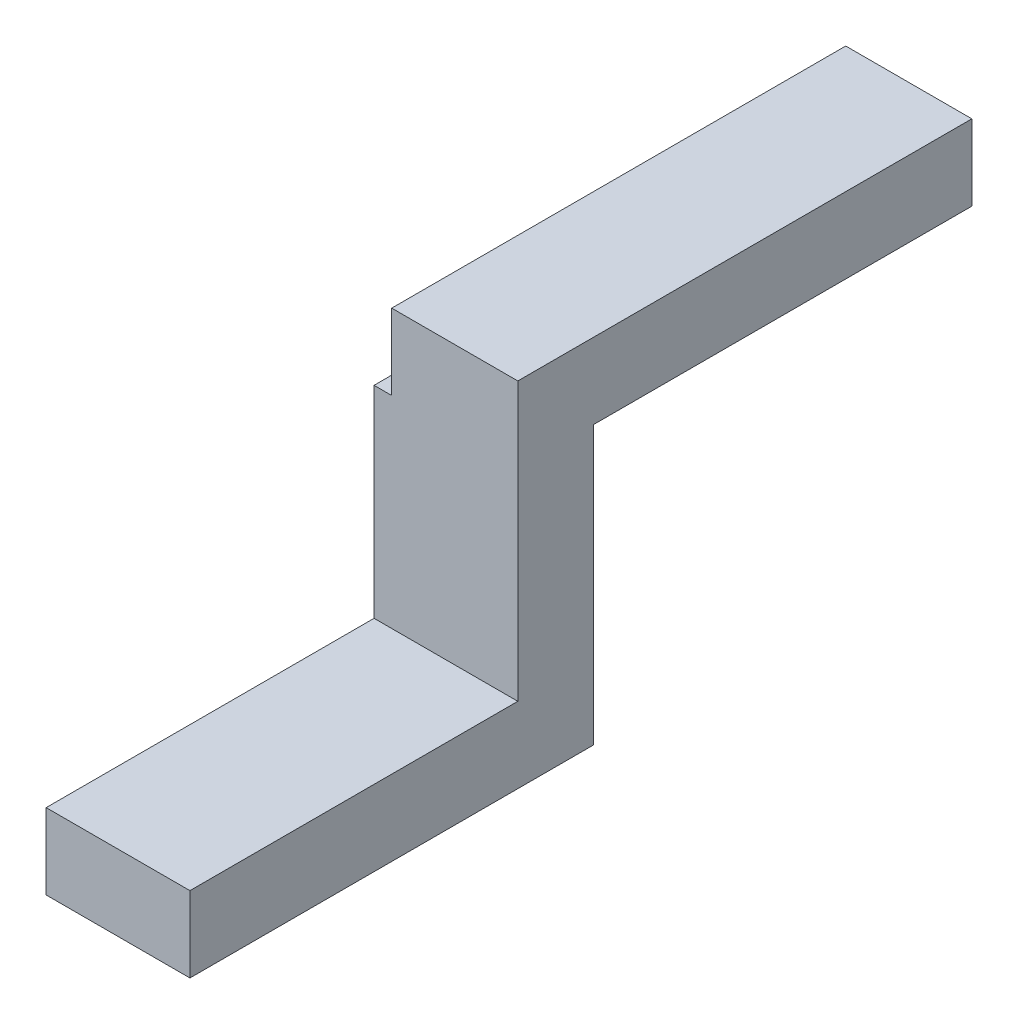
ISO-10303-21;
HEADER;
FILE_DESCRIPTION(('STEP AP214'),'2;1');
FILE_NAME('part.step','',(''),(''),'','','');
FILE_SCHEMA(('AUTOMOTIVE_DESIGN { 1 0 10303 214 1 1 1 1 }'));
ENDSEC;
DATA;
#1=APPLICATION_CONTEXT('core data for automotive mechanical design processes');
#2=APPLICATION_PROTOCOL_DEFINITION('international standard','automotive_design',2000,#1);
#3=PRODUCT_CONTEXT('',#1,'mechanical');
#4=PRODUCT('Part','Part','',(#3));
#5=PRODUCT_RELATED_PRODUCT_CATEGORY('part','',(#4));
#6=PRODUCT_DEFINITION_FORMATION('','',#4);
#7=PRODUCT_DEFINITION_CONTEXT('part definition',#1,'design');
#8=PRODUCT_DEFINITION('design','',#6,#7);
#9=PRODUCT_DEFINITION_SHAPE('','',#8);
#10=(LENGTH_UNIT() NAMED_UNIT(*) SI_UNIT(.MILLI.,.METRE.));
#11=(NAMED_UNIT(*) PLANE_ANGLE_UNIT() SI_UNIT($,.RADIAN.));
#12=(NAMED_UNIT(*) SI_UNIT($,.STERADIAN.) SOLID_ANGLE_UNIT());
#13=UNCERTAINTY_MEASURE_WITH_UNIT(LENGTH_MEASURE(1.E-05),#10,'distance_accuracy_value','');
#14=(GEOMETRIC_REPRESENTATION_CONTEXT(3) GLOBAL_UNCERTAINTY_ASSIGNED_CONTEXT((#13)) GLOBAL_UNIT_ASSIGNED_CONTEXT((#10,
#11,#12)) REPRESENTATION_CONTEXT('',''));
#15=CARTESIAN_POINT('',(0.,0.,0.));
#16=DIRECTION('',(0.,0.,1.));
#17=DIRECTION('',(1.,0.,0.));
#18=AXIS2_PLACEMENT_3D('',#15,#16,#17);
#19=CARTESIAN_POINT('',(5.7,0.,16.));
#20=DIRECTION('',(0.,0.,-1.));
#21=DIRECTION('',(-1.,0.,0.));
#22=AXIS2_PLACEMENT_3D('',#19,#20,#21);
#23=PLANE('',#22);
#24=DIRECTION('',(0.,-1.,0.));
#25=VECTOR('',#24,1.);
#26=CARTESIAN_POINT('',(0.,0.,16.));
#27=LINE('',#26,#25);
#28=CARTESIAN_POINT('',(0.,3.,16.));
#29=VERTEX_POINT('',#28);
#30=CARTESIAN_POINT('',(0.,0.,16.));
#31=VERTEX_POINT('',#30);
#32=EDGE_CURVE('E128',#29,#31,#27,.T.);
#33=ORIENTED_EDGE('',*,*,#32,.T.);
#34=DIRECTION('',(-1.,0.,0.));
#35=VECTOR('',#34,1.);
#36=CARTESIAN_POINT('',(5.7,0.,16.));
#37=LINE('',#36,#35);
#38=CARTESIAN_POINT('',(5.7,0.,16.));
#39=VERTEX_POINT('',#38);
#40=EDGE_CURVE('E41',#39,#31,#37,.T.);
#41=ORIENTED_EDGE('',*,*,#40,.F.);
#42=DIRECTION('',(0.,-1.,0.));
#43=VECTOR('',#42,1.);
#44=CARTESIAN_POINT('',(5.7,0.,16.));
#45=LINE('',#44,#43);
#46=CARTESIAN_POINT('',(5.7,3.,16.));
#47=VERTEX_POINT('',#46);
#48=EDGE_CURVE('E139',#47,#39,#45,.T.);
#49=ORIENTED_EDGE('',*,*,#48,.F.);
#50=DIRECTION('',(-1.,0.,0.));
#51=VECTOR('',#50,1.);
#52=CARTESIAN_POINT('',(5.7,3.,16.));
#53=LINE('',#52,#51);
#54=EDGE_CURVE('E124',#47,#29,#53,.T.);
#55=ORIENTED_EDGE('',*,*,#54,.T.);
#56=EDGE_LOOP('',(#33,#41,#49,#55));
#57=FACE_BOUND('',#56,.T.);
#58=ADVANCED_FACE('F33',(#57),#23,.F.);
#59=CARTESIAN_POINT('',(5.7,0.,0.));
#60=DIRECTION('',(0.,1.,0.));
#61=DIRECTION('',(0.,0.,1.));
#62=AXIS2_PLACEMENT_3D('',#59,#60,#61);
#63=PLANE('',#62);
#64=DIRECTION('',(0.,0.,-1.));
#65=VECTOR('',#64,1.);
#66=CARTESIAN_POINT('',(0.,0.,0.));
#67=LINE('',#66,#65);
#68=CARTESIAN_POINT('',(0.,0.,0.));
#69=VERTEX_POINT('',#68);
#70=EDGE_CURVE('E131',#31,#69,#67,.T.);
#71=ORIENTED_EDGE('',*,*,#70,.T.);
#72=DIRECTION('',(-1.,0.,0.));
#73=VECTOR('',#72,1.);
#74=CARTESIAN_POINT('',(5.7,0.,0.));
#75=LINE('',#74,#73);
#76=CARTESIAN_POINT('',(5.7,0.,0.));
#77=VERTEX_POINT('',#76);
#78=EDGE_CURVE('E149',#77,#69,#75,.T.);
#79=ORIENTED_EDGE('',*,*,#78,.F.);
#80=DIRECTION('',(0.,0.,-1.));
#81=VECTOR('',#80,1.);
#82=CARTESIAN_POINT('',(5.7,0.,0.));
#83=LINE('',#82,#81);
#84=EDGE_CURVE('E85',#39,#77,#83,.T.);
#85=ORIENTED_EDGE('',*,*,#84,.F.);
#86=ORIENTED_EDGE('',*,*,#40,.T.);
#87=EDGE_LOOP('',(#71,#79,#85,#86));
#88=FACE_BOUND('',#87,.T.);
#89=ADVANCED_FACE('F152',(#88),#63,.F.);
#90=CARTESIAN_POINT('',(5.7,11.,0.));
#91=DIRECTION('',(0.,0.,1.));
#92=DIRECTION('',(1.,0.,0.));
#93=AXIS2_PLACEMENT_3D('',#90,#91,#92);
#94=PLANE('',#93);
#95=DIRECTION('',(0.,1.,0.));
#96=VECTOR('',#95,1.);
#97=CARTESIAN_POINT('',(0.,11.,0.));
#98=LINE('',#97,#96);
#99=CARTESIAN_POINT('',(0.,11.,0.));
#100=VERTEX_POINT('',#99);
#101=EDGE_CURVE('E134',#69,#100,#98,.T.);
#102=ORIENTED_EDGE('',*,*,#101,.T.);
#103=DIRECTION('',(1.,0.,0.));
#104=VECTOR('',#103,1.);
#105=CARTESIAN_POINT('',(5.7,11.,0.));
#106=LINE('',#105,#104);
#107=CARTESIAN_POINT('',(0.7,11.,0.));
#108=VERTEX_POINT('',#107);
#109=EDGE_CURVE('E132',#100,#108,#106,.T.);
#110=ORIENTED_EDGE('',*,*,#109,.T.);
#111=DIRECTION('',(-1.,0.,0.));
#112=VECTOR('',#111,1.);
#113=CARTESIAN_POINT('',(5.7,11.,0.));
#114=LINE('',#113,#112);
#115=CARTESIAN_POINT('',(5.7,11.,0.));
#116=VERTEX_POINT('',#115);
#117=EDGE_CURVE('E146',#116,#108,#114,.T.);
#118=ORIENTED_EDGE('',*,*,#117,.F.);
#119=DIRECTION('',(0.,1.,0.));
#120=VECTOR('',#119,1.);
#121=CARTESIAN_POINT('',(5.7,11.,0.));
#122=LINE('',#121,#120);
#123=EDGE_CURVE('E165',#77,#116,#122,.T.);
#124=ORIENTED_EDGE('',*,*,#123,.F.);
#125=ORIENTED_EDGE('',*,*,#78,.T.);
#126=EDGE_LOOP('',(#102,#110,#118,#124,#125));
#127=FACE_BOUND('',#126,.T.);
#128=ADVANCED_FACE('F162',(#127),#94,.F.);
#129=CARTESIAN_POINT('',(5.7,11.,-15.));
#130=DIRECTION('',(0.,1.,0.));
#131=DIRECTION('',(0.,0.,1.));
#132=AXIS2_PLACEMENT_3D('',#129,#130,#131);
#133=PLANE('',#132);
#134=ORIENTED_EDGE('',*,*,#117,.T.);
#135=DIRECTION('',(0.,0.,1.));
#136=VECTOR('',#135,1.);
#137=CARTESIAN_POINT('',(0.7,11.,-15.));
#138=LINE('',#137,#136);
#139=CARTESIAN_POINT('',(0.7,11.,-15.));
#140=VERTEX_POINT('',#139);
#141=EDGE_CURVE('E174',#140,#108,#138,.T.);
#142=ORIENTED_EDGE('',*,*,#141,.F.);
#143=DIRECTION('',(-1.,0.,0.));
#144=VECTOR('',#143,1.);
#145=CARTESIAN_POINT('',(5.7,11.,-15.));
#146=LINE('',#145,#144);
#147=CARTESIAN_POINT('',(5.7,11.,-15.));
#148=VERTEX_POINT('',#147);
#149=EDGE_CURVE('E143',#148,#140,#146,.T.);
#150=ORIENTED_EDGE('',*,*,#149,.F.);
#151=DIRECTION('',(0.,0.,-1.));
#152=VECTOR('',#151,1.);
#153=CARTESIAN_POINT('',(5.7,11.,-15.));
#154=LINE('',#153,#152);
#155=EDGE_CURVE('E167',#116,#148,#154,.T.);
#156=ORIENTED_EDGE('',*,*,#155,.F.);
#157=EDGE_LOOP('',(#134,#142,#150,#156));
#158=FACE_BOUND('',#157,.T.);
#159=ADVANCED_FACE('F206',(#158),#133,.F.);
#160=CARTESIAN_POINT('',(5.7,14.,-15.));
#161=DIRECTION('',(0.,0.,1.));
#162=DIRECTION('',(1.,0.,0.));
#163=AXIS2_PLACEMENT_3D('',#160,#161,#162);
#164=PLANE('',#163);
#165=ORIENTED_EDGE('',*,*,#149,.T.);
#166=DIRECTION('',(0.,1.,0.));
#167=VECTOR('',#166,1.);
#168=CARTESIAN_POINT('',(0.7,14.,-15.));
#169=LINE('',#168,#167);
#170=CARTESIAN_POINT('',(0.7,14.,-15.));
#171=VERTEX_POINT('',#170);
#172=EDGE_CURVE('E182',#140,#171,#169,.T.);
#173=ORIENTED_EDGE('',*,*,#172,.T.);
#174=DIRECTION('',(-1.,0.,0.));
#175=VECTOR('',#174,1.);
#176=CARTESIAN_POINT('',(5.7,14.,-15.));
#177=LINE('',#176,#175);
#178=CARTESIAN_POINT('',(5.7,14.,-15.));
#179=VERTEX_POINT('',#178);
#180=EDGE_CURVE('E119',#179,#171,#177,.T.);
#181=ORIENTED_EDGE('',*,*,#180,.F.);
#182=DIRECTION('',(0.,1.,0.));
#183=VECTOR('',#182,1.);
#184=CARTESIAN_POINT('',(5.7,14.,-15.));
#185=LINE('',#184,#183);
#186=EDGE_CURVE('E106',#148,#179,#185,.T.);
#187=ORIENTED_EDGE('',*,*,#186,.F.);
#188=EDGE_LOOP('',(#165,#173,#181,#187));
#189=FACE_BOUND('',#188,.T.);
#190=ADVANCED_FACE('F207',(#189),#164,.F.);
#191=CARTESIAN_POINT('',(5.7,14.,3.));
#192=DIRECTION('',(0.,-1.,0.));
#193=DIRECTION('',(0.,0.,-1.));
#194=AXIS2_PLACEMENT_3D('',#191,#192,#193);
#195=PLANE('',#194);
#196=ORIENTED_EDGE('',*,*,#180,.T.);
#197=DIRECTION('',(0.,0.,1.));
#198=VECTOR('',#197,1.);
#199=CARTESIAN_POINT('',(0.7,14.,-15.));
#200=LINE('',#199,#198);
#201=CARTESIAN_POINT('',(0.7,14.,3.));
#202=VERTEX_POINT('',#201);
#203=EDGE_CURVE('E117',#171,#202,#200,.T.);
#204=ORIENTED_EDGE('',*,*,#203,.T.);
#205=DIRECTION('',(-1.,0.,0.));
#206=VECTOR('',#205,1.);
#207=CARTESIAN_POINT('',(5.7,14.,3.));
#208=LINE('',#207,#206);
#209=CARTESIAN_POINT('',(5.7,14.,3.));
#210=VERTEX_POINT('',#209);
#211=EDGE_CURVE('E113',#210,#202,#208,.T.);
#212=ORIENTED_EDGE('',*,*,#211,.F.);
#213=DIRECTION('',(0.,0.,1.));
#214=VECTOR('',#213,1.);
#215=CARTESIAN_POINT('',(5.7,14.,3.));
#216=LINE('',#215,#214);
#217=EDGE_CURVE('E100',#179,#210,#216,.T.);
#218=ORIENTED_EDGE('',*,*,#217,.F.);
#219=EDGE_LOOP('',(#196,#204,#212,#218));
#220=FACE_BOUND('',#219,.T.);
#221=ADVANCED_FACE('F114',(#220),#195,.F.);
#222=CARTESIAN_POINT('',(5.7,3.,3.));
#223=DIRECTION('',(0.,0.,-1.));
#224=DIRECTION('',(-1.,0.,0.));
#225=AXIS2_PLACEMENT_3D('',#222,#223,#224);
#226=PLANE('',#225);
#227=ORIENTED_EDGE('',*,*,#211,.T.);
#228=DIRECTION('',(0.,1.,0.));
#229=VECTOR('',#228,1.);
#230=CARTESIAN_POINT('',(0.7,14.,3.));
#231=LINE('',#230,#229);
#232=CARTESIAN_POINT('',(0.7,11.,3.));
#233=VERTEX_POINT('',#232);
#234=EDGE_CURVE('E179',#233,#202,#231,.T.);
#235=ORIENTED_EDGE('',*,*,#234,.F.);
#236=DIRECTION('',(1.,0.,0.));
#237=VECTOR('',#236,1.);
#238=CARTESIAN_POINT('',(0.,11.,3.));
#239=LINE('',#238,#237);
#240=CARTESIAN_POINT('',(0.,11.,3.));
#241=VERTEX_POINT('',#240);
#242=EDGE_CURVE('E183',#241,#233,#239,.T.);
#243=ORIENTED_EDGE('',*,*,#242,.F.);
#244=DIRECTION('',(0.,-1.,0.));
#245=VECTOR('',#244,1.);
#246=CARTESIAN_POINT('',(0.,3.,3.));
#247=LINE('',#246,#245);
#248=CARTESIAN_POINT('',(0.,3.,3.));
#249=VERTEX_POINT('',#248);
#250=EDGE_CURVE('E70',#241,#249,#247,.T.);
#251=ORIENTED_EDGE('',*,*,#250,.T.);
#252=DIRECTION('',(-1.,0.,0.));
#253=VECTOR('',#252,1.);
#254=CARTESIAN_POINT('',(5.7,3.,3.));
#255=LINE('',#254,#253);
#256=CARTESIAN_POINT('',(5.7,3.,3.));
#257=VERTEX_POINT('',#256);
#258=EDGE_CURVE('E120',#257,#249,#255,.T.);
#259=ORIENTED_EDGE('',*,*,#258,.F.);
#260=DIRECTION('',(0.,-1.,0.));
#261=VECTOR('',#260,1.);
#262=CARTESIAN_POINT('',(5.7,3.,3.));
#263=LINE('',#262,#261);
#264=EDGE_CURVE('E104',#210,#257,#263,.T.);
#265=ORIENTED_EDGE('',*,*,#264,.F.);
#266=EDGE_LOOP('',(#227,#235,#243,#251,#259,#265));
#267=FACE_BOUND('',#266,.T.);
#268=ADVANCED_FACE('F122',(#267),#226,.F.);
#269=CARTESIAN_POINT('',(5.7,3.,16.));
#270=DIRECTION('',(0.,-1.,0.));
#271=DIRECTION('',(0.,0.,-1.));
#272=AXIS2_PLACEMENT_3D('',#269,#270,#271);
#273=PLANE('',#272);
#274=DIRECTION('',(0.,0.,1.));
#275=VECTOR('',#274,1.);
#276=CARTESIAN_POINT('',(0.,3.,16.));
#277=LINE('',#276,#275);
#278=EDGE_CURVE('E76',#249,#29,#277,.T.);
#279=ORIENTED_EDGE('',*,*,#278,.T.);
#280=ORIENTED_EDGE('',*,*,#54,.F.);
#281=DIRECTION('',(0.,0.,1.));
#282=VECTOR('',#281,1.);
#283=CARTESIAN_POINT('',(5.7,3.,16.));
#284=LINE('',#283,#282);
#285=EDGE_CURVE('E49',#257,#47,#284,.T.);
#286=ORIENTED_EDGE('',*,*,#285,.F.);
#287=ORIENTED_EDGE('',*,*,#258,.T.);
#288=EDGE_LOOP('',(#279,#280,#286,#287));
#289=FACE_BOUND('',#288,.T.);
#290=ADVANCED_FACE('F250',(#289),#273,.F.);
#291=CARTESIAN_POINT('',(5.7,0.,0.));
#292=DIRECTION('',(-1.,0.,0.));
#293=DIRECTION('',(0.,0.,1.));
#294=AXIS2_PLACEMENT_3D('',#291,#292,#293);
#295=PLANE('',#294);
#296=ORIENTED_EDGE('',*,*,#48,.T.);
#297=ORIENTED_EDGE('',*,*,#84,.T.);
#298=ORIENTED_EDGE('',*,*,#123,.T.);
#299=ORIENTED_EDGE('',*,*,#155,.T.);
#300=ORIENTED_EDGE('',*,*,#186,.T.);
#301=ORIENTED_EDGE('',*,*,#217,.T.);
#302=ORIENTED_EDGE('',*,*,#264,.T.);
#303=ORIENTED_EDGE('',*,*,#285,.T.);
#304=EDGE_LOOP('',(#296,#297,#298,#299,#300,#301,#302,#303));
#305=FACE_BOUND('',#304,.T.);
#306=ADVANCED_FACE('F102',(#305),#295,.F.);
#307=CARTESIAN_POINT('',(0.,0.,0.));
#308=DIRECTION('',(-1.,0.,0.));
#309=DIRECTION('',(0.,0.,1.));
#310=AXIS2_PLACEMENT_3D('',#307,#308,#309);
#311=PLANE('',#310);
#312=DIRECTION('',(0.,0.,1.));
#313=VECTOR('',#312,1.);
#314=CARTESIAN_POINT('',(0.,11.,0.));
#315=LINE('',#314,#313);
#316=EDGE_CURVE('E11',#100,#241,#315,.T.);
#317=ORIENTED_EDGE('',*,*,#316,.F.);
#318=ORIENTED_EDGE('',*,*,#101,.F.);
#319=ORIENTED_EDGE('',*,*,#70,.F.);
#320=ORIENTED_EDGE('',*,*,#32,.F.);
#321=ORIENTED_EDGE('',*,*,#278,.F.);
#322=ORIENTED_EDGE('',*,*,#250,.F.);
#323=EDGE_LOOP('',(#317,#318,#319,#320,#321,#322));
#324=FACE_BOUND('',#323,.T.);
#325=ADVANCED_FACE('F158',(#324),#311,.T.);
#326=CARTESIAN_POINT('',(0.,11.,-15.));
#327=DIRECTION('',(0.,-1.,0.));
#328=DIRECTION('',(0.,0.,-1.));
#329=AXIS2_PLACEMENT_3D('',#326,#327,#328);
#330=PLANE('',#329);
#331=ORIENTED_EDGE('',*,*,#316,.T.);
#332=ORIENTED_EDGE('',*,*,#242,.T.);
#333=EDGE_CURVE('E177',#108,#233,#138,.T.);
#334=ORIENTED_EDGE('',*,*,#333,.F.);
#335=ORIENTED_EDGE('',*,*,#109,.F.);
#336=EDGE_LOOP('',(#331,#332,#334,#335));
#337=FACE_BOUND('',#336,.T.);
#338=ADVANCED_FACE('F199',(#337),#330,.F.);
#339=CARTESIAN_POINT('',(0.7,14.,-15.));
#340=DIRECTION('',(1.,0.,0.));
#341=DIRECTION('',(0.,1.,0.));
#342=AXIS2_PLACEMENT_3D('',#339,#340,#341);
#343=PLANE('',#342);
#344=ORIENTED_EDGE('',*,*,#234,.T.);
#345=ORIENTED_EDGE('',*,*,#203,.F.);
#346=ORIENTED_EDGE('',*,*,#172,.F.);
#347=ORIENTED_EDGE('',*,*,#141,.T.);
#348=ORIENTED_EDGE('',*,*,#333,.T.);
#349=EDGE_LOOP('',(#344,#345,#346,#347,#348));
#350=FACE_BOUND('',#349,.T.);
#351=ADVANCED_FACE('F194',(#350),#343,.F.);
#352=CLOSED_SHELL('',(#58,#89,#128,#159,#190,#221,#268,#290,#306,#325,#338,#351));
#353=MANIFOLD_SOLID_BREP('B2',#352);
#354=ADVANCED_BREP_SHAPE_REPRESENTATION('',(#18,#353),#14);
#355=SHAPE_DEFINITION_REPRESENTATION(#9,#354);
ENDSEC;
END-ISO-10303-21;
